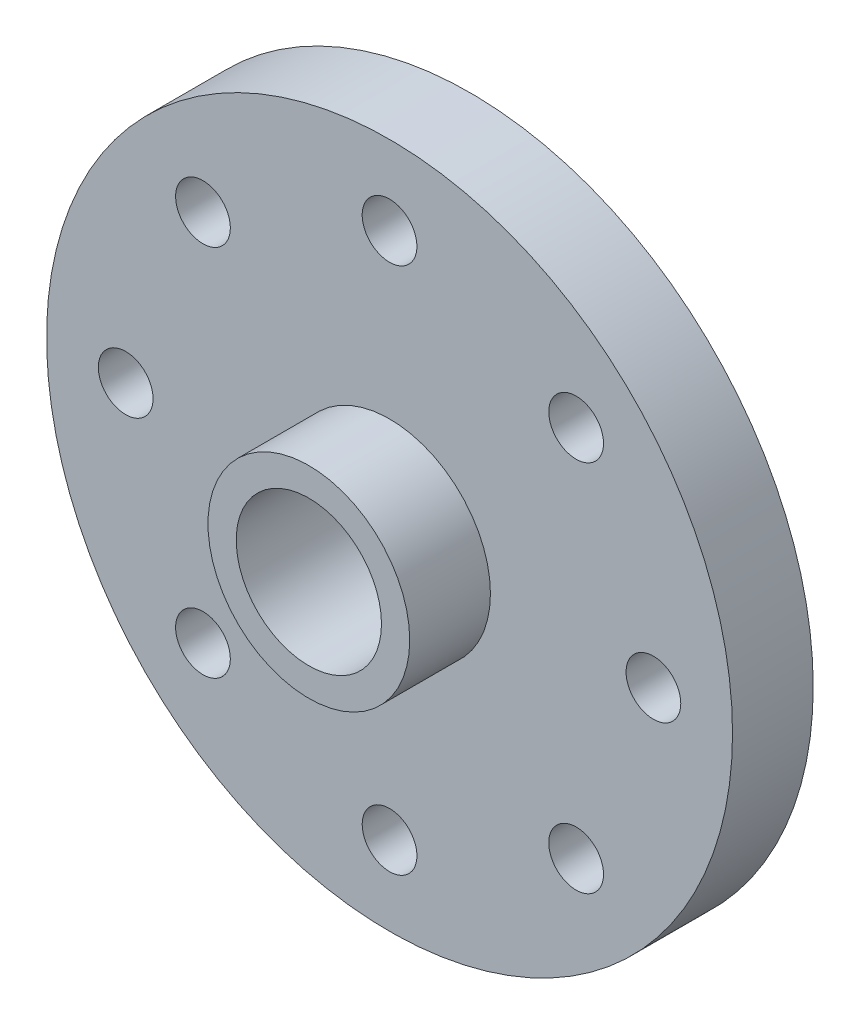
ISO-10303-21;
HEADER;
FILE_DESCRIPTION(('STEP AP214'),'2;1');
FILE_NAME('part.step','',(''),(''),'','','');
FILE_SCHEMA(('AUTOMOTIVE_DESIGN { 1 0 10303 214 1 1 1 1 }'));
ENDSEC;
DATA;
#1=APPLICATION_CONTEXT('core data for automotive mechanical design processes');
#2=APPLICATION_PROTOCOL_DEFINITION('international standard','automotive_design',2000,#1);
#3=PRODUCT_CONTEXT('',#1,'mechanical');
#4=PRODUCT('Part','Part','',(#3));
#5=PRODUCT_RELATED_PRODUCT_CATEGORY('part','',(#4));
#6=PRODUCT_DEFINITION_FORMATION('','',#4);
#7=PRODUCT_DEFINITION_CONTEXT('part definition',#1,'design');
#8=PRODUCT_DEFINITION('design','',#6,#7);
#9=PRODUCT_DEFINITION_SHAPE('','',#8);
#10=(LENGTH_UNIT() NAMED_UNIT(*) SI_UNIT(.MILLI.,.METRE.));
#11=(NAMED_UNIT(*) PLANE_ANGLE_UNIT() SI_UNIT($,.RADIAN.));
#12=(NAMED_UNIT(*) SI_UNIT($,.STERADIAN.) SOLID_ANGLE_UNIT());
#13=UNCERTAINTY_MEASURE_WITH_UNIT(LENGTH_MEASURE(1.E-05),#10,'distance_accuracy_value','');
#14=(GEOMETRIC_REPRESENTATION_CONTEXT(3) GLOBAL_UNCERTAINTY_ASSIGNED_CONTEXT((#13)) GLOBAL_UNIT_ASSIGNED_CONTEXT((#10,
#11,#12)) REPRESENTATION_CONTEXT('',''));
#15=CARTESIAN_POINT('',(0.,0.,0.));
#16=DIRECTION('',(0.,0.,1.));
#17=DIRECTION('',(1.,0.,0.));
#18=AXIS2_PLACEMENT_3D('',#15,#16,#17);
#19=CARTESIAN_POINT('',(0.,0.,10.));
#20=DIRECTION('',(0.,0.,-1.));
#21=DIRECTION('',(-1.,0.,0.));
#22=AXIS2_PLACEMENT_3D('',#19,#20,#21);
#23=CYLINDRICAL_SURFACE('',#22,42.5);
#24=CARTESIAN_POINT('',(0.,0.,10.));
#25=DIRECTION('',(0.,0.,1.));
#26=DIRECTION('',(1.,0.,0.));
#27=AXIS2_PLACEMENT_3D('',#24,#25,#26);
#28=CIRCLE('',#27,42.5);
#29=CARTESIAN_POINT('',(42.5,0.,10.));
#30=VERTEX_POINT('',#29);
#31=EDGE_CURVE('E10',#30,#30,#28,.T.);
#32=ORIENTED_EDGE('',*,*,#31,.F.);
#33=EDGE_LOOP('',(#32));
#34=FACE_BOUND('',#33,.T.);
#35=CARTESIAN_POINT('',(0.,0.,0.));
#36=DIRECTION('',(0.,0.,1.));
#37=DIRECTION('',(1.,0.,0.));
#38=AXIS2_PLACEMENT_3D('',#35,#36,#37);
#39=CIRCLE('',#38,42.5);
#40=CARTESIAN_POINT('',(42.5,0.,0.));
#41=VERTEX_POINT('',#40);
#42=EDGE_CURVE('E34',#41,#41,#39,.T.);
#43=ORIENTED_EDGE('',*,*,#42,.T.);
#44=EDGE_LOOP('',(#43));
#45=FACE_BOUND('',#44,.T.);
#46=ADVANCED_FACE('F31',(#34,#45),#23,.T.);
#47=CARTESIAN_POINT('',(0.,0.,10.));
#48=DIRECTION('',(0.,0.,1.));
#49=DIRECTION('',(1.,0.,0.));
#50=AXIS2_PLACEMENT_3D('',#47,#48,#49);
#51=PLANE('',#50);
#52=CARTESIAN_POINT('',(32.6966007483858,-1.14159571356593E-13,10.));
#53=DIRECTION('',(0.,0.,1.));
#54=DIRECTION('',(0.,-1.,0.));
#55=AXIS2_PLACEMENT_3D('',#52,#53,#54);
#56=CIRCLE('',#55,3.39089926406692);
#57=CARTESIAN_POINT('',(32.6966007483857,-3.39089926406703,10.));
#58=VERTEX_POINT('',#57);
#59=EDGE_CURVE('E95',#58,#58,#56,.T.);
#60=ORIENTED_EDGE('',*,*,#59,.F.);
#61=EDGE_LOOP('',(#60));
#62=FACE_BOUND('',#61,.T.);
#63=CARTESIAN_POINT('',(23.1199881109326,-23.1199881109328,10.));
#64=DIRECTION('',(0.,0.,1.));
#65=DIRECTION('',(-0.707106781186551,-0.707106781186544,0.));
#66=AXIS2_PLACEMENT_3D('',#63,#64,#65);
#67=CIRCLE('',#66,3.39089926406692);
#68=CARTESIAN_POINT('',(20.7222602469904,-25.517715974875,10.));
#69=VERTEX_POINT('',#68);
#70=EDGE_CURVE('E89',#69,#69,#67,.T.);
#71=ORIENTED_EDGE('',*,*,#70,.F.);
#72=EDGE_LOOP('',(#71));
#73=FACE_BOUND('',#72,.T.);
#74=CARTESIAN_POINT('',(0.,-32.6966007483858,10.));
#75=DIRECTION('',(0.,0.,1.));
#76=DIRECTION('',(-1.,0.,0.));
#77=AXIS2_PLACEMENT_3D('',#74,#75,#76);
#78=CIRCLE('',#77,3.39089926406692);
#79=CARTESIAN_POINT('',(-3.39089926406692,-32.6966007483858,10.));
#80=VERTEX_POINT('',#79);
#81=EDGE_CURVE('E83',#80,#80,#78,.T.);
#82=ORIENTED_EDGE('',*,*,#81,.F.);
#83=EDGE_LOOP('',(#82));
#84=FACE_BOUND('',#83,.T.);
#85=CARTESIAN_POINT('',(-23.1199881109329,-23.1199881109325,10.));
#86=DIRECTION('',(0.,0.,1.));
#87=DIRECTION('',(-0.707106781186541,0.707106781186554,0.));
#88=AXIS2_PLACEMENT_3D('',#85,#86,#87);
#89=CIRCLE('',#88,3.39089926406692);
#90=CARTESIAN_POINT('',(-25.5177159748751,-20.7222602469903,10.));
#91=VERTEX_POINT('',#90);
#92=EDGE_CURVE('E77',#91,#91,#89,.T.);
#93=ORIENTED_EDGE('',*,*,#92,.F.);
#94=EDGE_LOOP('',(#93));
#95=FACE_BOUND('',#94,.T.);
#96=CARTESIAN_POINT('',(-32.6966007483858,3.4247871406978E-13,10.));
#97=DIRECTION('',(0.,0.,1.));
#98=DIRECTION('',(0.,1.,0.));
#99=AXIS2_PLACEMENT_3D('',#96,#97,#98);
#100=CIRCLE('',#99,3.39089926406692);
#101=CARTESIAN_POINT('',(-32.6966007483857,3.39089926406726,10.));
#102=VERTEX_POINT('',#101);
#103=EDGE_CURVE('E70',#102,#102,#100,.T.);
#104=ORIENTED_EDGE('',*,*,#103,.F.);
#105=EDGE_LOOP('',(#104));
#106=FACE_BOUND('',#105,.T.);
#107=CARTESIAN_POINT('',(-23.1199881109324,23.119988110933,10.));
#108=DIRECTION('',(0.,0.,1.));
#109=DIRECTION('',(0.707106781186556,0.707106781186539,0.));
#110=AXIS2_PLACEMENT_3D('',#107,#108,#109);
#111=CIRCLE('',#110,3.39089926406692);
#112=CARTESIAN_POINT('',(-20.7222602469902,25.5177159748752,10.));
#113=VERTEX_POINT('',#112);
#114=EDGE_CURVE('E71',#113,#113,#111,.T.);
#115=ORIENTED_EDGE('',*,*,#114,.F.);
#116=EDGE_LOOP('',(#115));
#117=FACE_BOUND('',#116,.T.);
#118=CARTESIAN_POINT('',(23.1199881109328,23.1199881109327,10.));
#119=DIRECTION('',(0.,0.,1.));
#120=DIRECTION('',(0.707106781186546,-0.707106781186549,0.));
#121=AXIS2_PLACEMENT_3D('',#118,#119,#120);
#122=CIRCLE('',#121,3.39089926406692);
#123=CARTESIAN_POINT('',(25.5177159748749,20.7222602469905,10.));
#124=VERTEX_POINT('',#123);
#125=EDGE_CURVE('E63',#124,#124,#122,.T.);
#126=ORIENTED_EDGE('',*,*,#125,.F.);
#127=EDGE_LOOP('',(#126));
#128=FACE_BOUND('',#127,.T.);
#129=CARTESIAN_POINT('',(0.,32.6966007483858,10.));
#130=DIRECTION('',(0.,0.,1.));
#131=DIRECTION('',(1.,0.,0.));
#132=AXIS2_PLACEMENT_3D('',#129,#130,#131);
#133=CIRCLE('',#132,3.39089926406692);
#134=CARTESIAN_POINT('',(3.39089926406692,32.6966007483858,10.));
#135=VERTEX_POINT('',#134);
#136=EDGE_CURVE('E57',#135,#135,#133,.T.);
#137=ORIENTED_EDGE('',*,*,#136,.F.);
#138=EDGE_LOOP('',(#137));
#139=FACE_BOUND('',#138,.T.);
#140=CARTESIAN_POINT('',(0.,0.,10.));
#141=DIRECTION('',(0.,0.,1.));
#142=DIRECTION('',(1.,0.,0.));
#143=AXIS2_PLACEMENT_3D('',#140,#141,#142);
#144=CIRCLE('',#143,12.5);
#145=CARTESIAN_POINT('',(12.5,0.,10.));
#146=VERTEX_POINT('',#145);
#147=EDGE_CURVE('E43',#146,#146,#144,.T.);
#148=ORIENTED_EDGE('',*,*,#147,.F.);
#149=EDGE_LOOP('',(#148));
#150=FACE_BOUND('',#149,.T.);
#151=ORIENTED_EDGE('',*,*,#31,.T.);
#152=EDGE_LOOP('',(#151));
#153=FACE_BOUND('',#152,.T.);
#154=ADVANCED_FACE('F105',(#62,#73,#84,#95,#106,#117,#128,#139,#150,#153),#51,.T.);
#155=CARTESIAN_POINT('',(0.,0.,0.));
#156=DIRECTION('',(0.,0.,1.));
#157=DIRECTION('',(1.,0.,0.));
#158=AXIS2_PLACEMENT_3D('',#155,#156,#157);
#159=PLANE('',#158);
#160=CARTESIAN_POINT('',(32.6966007483858,-1.14159571356593E-13,0.));
#161=DIRECTION('',(0.,0.,1.));
#162=DIRECTION('',(1.,0.,0.));
#163=AXIS2_PLACEMENT_3D('',#160,#161,#162);
#164=CIRCLE('',#163,3.39089926406692);
#165=CARTESIAN_POINT('',(36.0875000124527,-1.14159571356593E-13,0.));
#166=VERTEX_POINT('',#165);
#167=EDGE_CURVE('E66',#166,#166,#164,.F.);
#168=ORIENTED_EDGE('',*,*,#167,.F.);
#169=EDGE_LOOP('',(#168));
#170=FACE_BOUND('',#169,.T.);
#171=CARTESIAN_POINT('',(23.1199881109326,-23.1199881109328,0.));
#172=DIRECTION('',(0.,0.,1.));
#173=DIRECTION('',(1.,0.,0.));
#174=AXIS2_PLACEMENT_3D('',#171,#172,#173);
#175=CIRCLE('',#174,3.39089926406692);
#176=CARTESIAN_POINT('',(26.5108873749995,-23.1199881109328,0.));
#177=VERTEX_POINT('',#176);
#178=EDGE_CURVE('E92',#177,#177,#175,.F.);
#179=ORIENTED_EDGE('',*,*,#178,.F.);
#180=EDGE_LOOP('',(#179));
#181=FACE_BOUND('',#180,.T.);
#182=CARTESIAN_POINT('',(0.,-32.6966007483858,0.));
#183=DIRECTION('',(0.,0.,1.));
#184=DIRECTION('',(1.,0.,0.));
#185=AXIS2_PLACEMENT_3D('',#182,#183,#184);
#186=CIRCLE('',#185,3.39089926406692);
#187=CARTESIAN_POINT('',(3.39089926406692,-32.6966007483858,0.));
#188=VERTEX_POINT('',#187);
#189=EDGE_CURVE('E86',#188,#188,#186,.F.);
#190=ORIENTED_EDGE('',*,*,#189,.F.);
#191=EDGE_LOOP('',(#190));
#192=FACE_BOUND('',#191,.T.);
#193=CARTESIAN_POINT('',(-23.1199881109329,-23.1199881109325,0.));
#194=DIRECTION('',(0.,0.,1.));
#195=DIRECTION('',(1.,0.,0.));
#196=AXIS2_PLACEMENT_3D('',#193,#194,#195);
#197=CIRCLE('',#196,3.39089926406692);
#198=CARTESIAN_POINT('',(-19.729088846866,-23.1199881109325,0.));
#199=VERTEX_POINT('',#198);
#200=EDGE_CURVE('E80',#199,#199,#197,.F.);
#201=ORIENTED_EDGE('',*,*,#200,.F.);
#202=EDGE_LOOP('',(#201));
#203=FACE_BOUND('',#202,.T.);
#204=CARTESIAN_POINT('',(-32.6966007483858,3.4247871406978E-13,0.));
#205=DIRECTION('',(0.,0.,1.));
#206=DIRECTION('',(1.,0.,0.));
#207=AXIS2_PLACEMENT_3D('',#204,#205,#206);
#208=CIRCLE('',#207,3.39089926406692);
#209=CARTESIAN_POINT('',(-29.3057014843188,3.4247871406978E-13,0.));
#210=VERTEX_POINT('',#209);
#211=EDGE_CURVE('E74',#210,#210,#208,.F.);
#212=ORIENTED_EDGE('',*,*,#211,.F.);
#213=EDGE_LOOP('',(#212));
#214=FACE_BOUND('',#213,.T.);
#215=CARTESIAN_POINT('',(-23.1199881109324,23.119988110933,0.));
#216=DIRECTION('',(0.,0.,1.));
#217=DIRECTION('',(1.,0.,0.));
#218=AXIS2_PLACEMENT_3D('',#215,#216,#217);
#219=CIRCLE('',#218,3.39089926406692);
#220=CARTESIAN_POINT('',(-19.7290888468655,23.119988110933,0.));
#221=VERTEX_POINT('',#220);
#222=EDGE_CURVE('E67',#221,#221,#219,.F.);
#223=ORIENTED_EDGE('',*,*,#222,.F.);
#224=EDGE_LOOP('',(#223));
#225=FACE_BOUND('',#224,.T.);
#226=CARTESIAN_POINT('',(23.1199881109328,23.1199881109327,0.));
#227=DIRECTION('',(0.,0.,1.));
#228=DIRECTION('',(1.,0.,0.));
#229=AXIS2_PLACEMENT_3D('',#226,#227,#228);
#230=CIRCLE('',#229,3.39089926406692);
#231=CARTESIAN_POINT('',(26.5108873749997,23.1199881109327,0.));
#232=VERTEX_POINT('',#231);
#233=EDGE_CURVE('E60',#232,#232,#230,.F.);
#234=ORIENTED_EDGE('',*,*,#233,.F.);
#235=EDGE_LOOP('',(#234));
#236=FACE_BOUND('',#235,.T.);
#237=CARTESIAN_POINT('',(0.,32.6966007483858,0.));
#238=DIRECTION('',(0.,0.,1.));
#239=DIRECTION('',(1.,0.,0.));
#240=AXIS2_PLACEMENT_3D('',#237,#238,#239);
#241=CIRCLE('',#240,3.39089926406692);
#242=CARTESIAN_POINT('',(3.39089926406692,32.6966007483858,0.));
#243=VERTEX_POINT('',#242);
#244=EDGE_CURVE('E54',#243,#243,#241,.F.);
#245=ORIENTED_EDGE('',*,*,#244,.F.);
#246=EDGE_LOOP('',(#245));
#247=FACE_BOUND('',#246,.T.);
#248=CARTESIAN_POINT('',(0.,0.,0.));
#249=DIRECTION('',(0.,0.,1.));
#250=DIRECTION('',(1.,0.,0.));
#251=AXIS2_PLACEMENT_3D('',#248,#249,#250);
#252=CIRCLE('',#251,9.);
#253=CARTESIAN_POINT('',(9.,0.,0.));
#254=VERTEX_POINT('',#253);
#255=EDGE_CURVE('E46',#254,#254,#252,.F.);
#256=ORIENTED_EDGE('',*,*,#255,.F.);
#257=EDGE_LOOP('',(#256));
#258=FACE_BOUND('',#257,.T.);
#259=ORIENTED_EDGE('',*,*,#42,.F.);
#260=EDGE_LOOP('',(#259));
#261=FACE_BOUND('',#260,.T.);
#262=ADVANCED_FACE('F108',(#170,#181,#192,#203,#214,#225,#236,#247,#258,#261),#159,.F.);
#263=CARTESIAN_POINT('',(0.,0.,20.));
#264=DIRECTION('',(0.,0.,-1.));
#265=DIRECTION('',(-1.,0.,0.));
#266=AXIS2_PLACEMENT_3D('',#263,#264,#265);
#267=CYLINDRICAL_SURFACE('',#266,12.5);
#268=CARTESIAN_POINT('',(0.,0.,20.));
#269=DIRECTION('',(0.,0.,1.));
#270=DIRECTION('',(1.,0.,0.));
#271=AXIS2_PLACEMENT_3D('',#268,#269,#270);
#272=CIRCLE('',#271,12.5);
#273=CARTESIAN_POINT('',(12.5,0.,20.));
#274=VERTEX_POINT('',#273);
#275=EDGE_CURVE('E41',#274,#274,#272,.T.);
#276=ORIENTED_EDGE('',*,*,#275,.F.);
#277=EDGE_LOOP('',(#276));
#278=FACE_BOUND('',#277,.T.);
#279=ORIENTED_EDGE('',*,*,#147,.T.);
#280=EDGE_LOOP('',(#279));
#281=FACE_BOUND('',#280,.T.);
#282=ADVANCED_FACE('F126',(#278,#281),#267,.T.);
#283=CARTESIAN_POINT('',(0.,0.,20.));
#284=DIRECTION('',(0.,0.,1.));
#285=DIRECTION('',(1.,0.,0.));
#286=AXIS2_PLACEMENT_3D('',#283,#284,#285);
#287=PLANE('',#286);
#288=CARTESIAN_POINT('',(0.,0.,20.));
#289=DIRECTION('',(0.,0.,1.));
#290=DIRECTION('',(1.,0.,0.));
#291=AXIS2_PLACEMENT_3D('',#288,#289,#290);
#292=CIRCLE('',#291,9.);
#293=CARTESIAN_POINT('',(9.,0.,20.));
#294=VERTEX_POINT('',#293);
#295=EDGE_CURVE('E51',#294,#294,#292,.T.);
#296=ORIENTED_EDGE('',*,*,#295,.F.);
#297=EDGE_LOOP('',(#296));
#298=FACE_BOUND('',#297,.T.);
#299=ORIENTED_EDGE('',*,*,#275,.T.);
#300=EDGE_LOOP('',(#299));
#301=FACE_BOUND('',#300,.T.);
#302=ADVANCED_FACE('F128',(#298,#301),#287,.T.);
#303=CARTESIAN_POINT('',(0.,0.,-25.4558441227157));
#304=DIRECTION('',(0.,0.,1.));
#305=DIRECTION('',(1.,0.,0.));
#306=AXIS2_PLACEMENT_3D('',#303,#304,#305);
#307=CYLINDRICAL_SURFACE('',#306,9.);
#308=ORIENTED_EDGE('',*,*,#255,.T.);
#309=EDGE_LOOP('',(#308));
#310=FACE_BOUND('',#309,.T.);
#311=ORIENTED_EDGE('',*,*,#295,.T.);
#312=EDGE_LOOP('',(#311));
#313=FACE_BOUND('',#312,.T.);
#314=ADVANCED_FACE('F135',(#310,#313),#307,.F.);
#315=CARTESIAN_POINT('',(0.,32.6966007483858,-9.59091145576876));
#316=DIRECTION('',(0.,0.,1.));
#317=DIRECTION('',(1.,0.,0.));
#318=AXIS2_PLACEMENT_3D('',#315,#316,#317);
#319=CYLINDRICAL_SURFACE('',#318,3.39089926406692);
#320=ORIENTED_EDGE('',*,*,#244,.T.);
#321=EDGE_LOOP('',(#320));
#322=FACE_BOUND('',#321,.T.);
#323=ORIENTED_EDGE('',*,*,#136,.T.);
#324=EDGE_LOOP('',(#323));
#325=FACE_BOUND('',#324,.T.);
#326=ADVANCED_FACE('F170',(#322,#325),#319,.F.);
#327=CARTESIAN_POINT('',(23.1199881109328,23.1199881109327,-9.59091145576876));
#328=DIRECTION('',(0.,0.,1.));
#329=DIRECTION('',(1.,0.,0.));
#330=AXIS2_PLACEMENT_3D('',#327,#328,#329);
#331=CYLINDRICAL_SURFACE('',#330,3.39089926406692);
#332=ORIENTED_EDGE('',*,*,#233,.T.);
#333=EDGE_LOOP('',(#332));
#334=FACE_BOUND('',#333,.T.);
#335=ORIENTED_EDGE('',*,*,#125,.T.);
#336=EDGE_LOOP('',(#335));
#337=FACE_BOUND('',#336,.T.);
#338=ADVANCED_FACE('F164',(#334,#337),#331,.F.);
#339=CARTESIAN_POINT('',(-23.1199881109324,23.119988110933,-9.59091145576876));
#340=DIRECTION('',(0.,0.,1.));
#341=DIRECTION('',(1.,0.,0.));
#342=AXIS2_PLACEMENT_3D('',#339,#340,#341);
#343=CYLINDRICAL_SURFACE('',#342,3.39089926406692);
#344=ORIENTED_EDGE('',*,*,#222,.T.);
#345=EDGE_LOOP('',(#344));
#346=FACE_BOUND('',#345,.T.);
#347=ORIENTED_EDGE('',*,*,#114,.T.);
#348=EDGE_LOOP('',(#347));
#349=FACE_BOUND('',#348,.T.);
#350=ADVANCED_FACE('F169',(#346,#349),#343,.F.);
#351=CARTESIAN_POINT('',(-32.6966007483858,3.4247871406978E-13,-9.59091145576876));
#352=DIRECTION('',(0.,0.,1.));
#353=DIRECTION('',(1.,0.,0.));
#354=AXIS2_PLACEMENT_3D('',#351,#352,#353);
#355=CYLINDRICAL_SURFACE('',#354,3.39089926406692);
#356=ORIENTED_EDGE('',*,*,#211,.T.);
#357=EDGE_LOOP('',(#356));
#358=FACE_BOUND('',#357,.T.);
#359=ORIENTED_EDGE('',*,*,#103,.T.);
#360=EDGE_LOOP('',(#359));
#361=FACE_BOUND('',#360,.T.);
#362=ADVANCED_FACE('F182',(#358,#361),#355,.F.);
#363=CARTESIAN_POINT('',(-23.1199881109329,-23.1199881109325,-9.59091145576876));
#364=DIRECTION('',(0.,0.,1.));
#365=DIRECTION('',(1.,0.,0.));
#366=AXIS2_PLACEMENT_3D('',#363,#364,#365);
#367=CYLINDRICAL_SURFACE('',#366,3.39089926406692);
#368=ORIENTED_EDGE('',*,*,#200,.T.);
#369=EDGE_LOOP('',(#368));
#370=FACE_BOUND('',#369,.T.);
#371=ORIENTED_EDGE('',*,*,#92,.T.);
#372=EDGE_LOOP('',(#371));
#373=FACE_BOUND('',#372,.T.);
#374=ADVANCED_FACE('F192',(#370,#373),#367,.F.);
#375=CARTESIAN_POINT('',(0.,-32.6966007483858,-9.59091145576876));
#376=DIRECTION('',(0.,0.,1.));
#377=DIRECTION('',(1.,0.,0.));
#378=AXIS2_PLACEMENT_3D('',#375,#376,#377);
#379=CYLINDRICAL_SURFACE('',#378,3.39089926406692);
#380=ORIENTED_EDGE('',*,*,#189,.T.);
#381=EDGE_LOOP('',(#380));
#382=FACE_BOUND('',#381,.T.);
#383=ORIENTED_EDGE('',*,*,#81,.T.);
#384=EDGE_LOOP('',(#383));
#385=FACE_BOUND('',#384,.T.);
#386=ADVANCED_FACE('F202',(#382,#385),#379,.F.);
#387=CARTESIAN_POINT('',(23.1199881109326,-23.1199881109328,-9.59091145576876));
#388=DIRECTION('',(0.,0.,1.));
#389=DIRECTION('',(1.,0.,0.));
#390=AXIS2_PLACEMENT_3D('',#387,#388,#389);
#391=CYLINDRICAL_SURFACE('',#390,3.39089926406692);
#392=ORIENTED_EDGE('',*,*,#178,.T.);
#393=EDGE_LOOP('',(#392));
#394=FACE_BOUND('',#393,.T.);
#395=ORIENTED_EDGE('',*,*,#70,.T.);
#396=EDGE_LOOP('',(#395));
#397=FACE_BOUND('',#396,.T.);
#398=ADVANCED_FACE('F212',(#394,#397),#391,.F.);
#399=CARTESIAN_POINT('',(32.6966007483858,-1.14159571356593E-13,-9.59091145576876));
#400=DIRECTION('',(0.,0.,1.));
#401=DIRECTION('',(1.,0.,0.));
#402=AXIS2_PLACEMENT_3D('',#399,#400,#401);
#403=CYLINDRICAL_SURFACE('',#402,3.39089926406692);
#404=ORIENTED_EDGE('',*,*,#167,.T.);
#405=EDGE_LOOP('',(#404));
#406=FACE_BOUND('',#405,.T.);
#407=ORIENTED_EDGE('',*,*,#59,.T.);
#408=EDGE_LOOP('',(#407));
#409=FACE_BOUND('',#408,.T.);
#410=ADVANCED_FACE('F103',(#406,#409),#403,.F.);
#411=CLOSED_SHELL('',(#46,#154,#262,#282,#302,#314,#326,#338,#350,#362,#374,#386,#398,#410));
#412=MANIFOLD_SOLID_BREP('B2',#411);
#413=ADVANCED_BREP_SHAPE_REPRESENTATION('',(#18,#412),#14);
#414=SHAPE_DEFINITION_REPRESENTATION(#9,#413);
ENDSEC;
END-ISO-10303-21;
